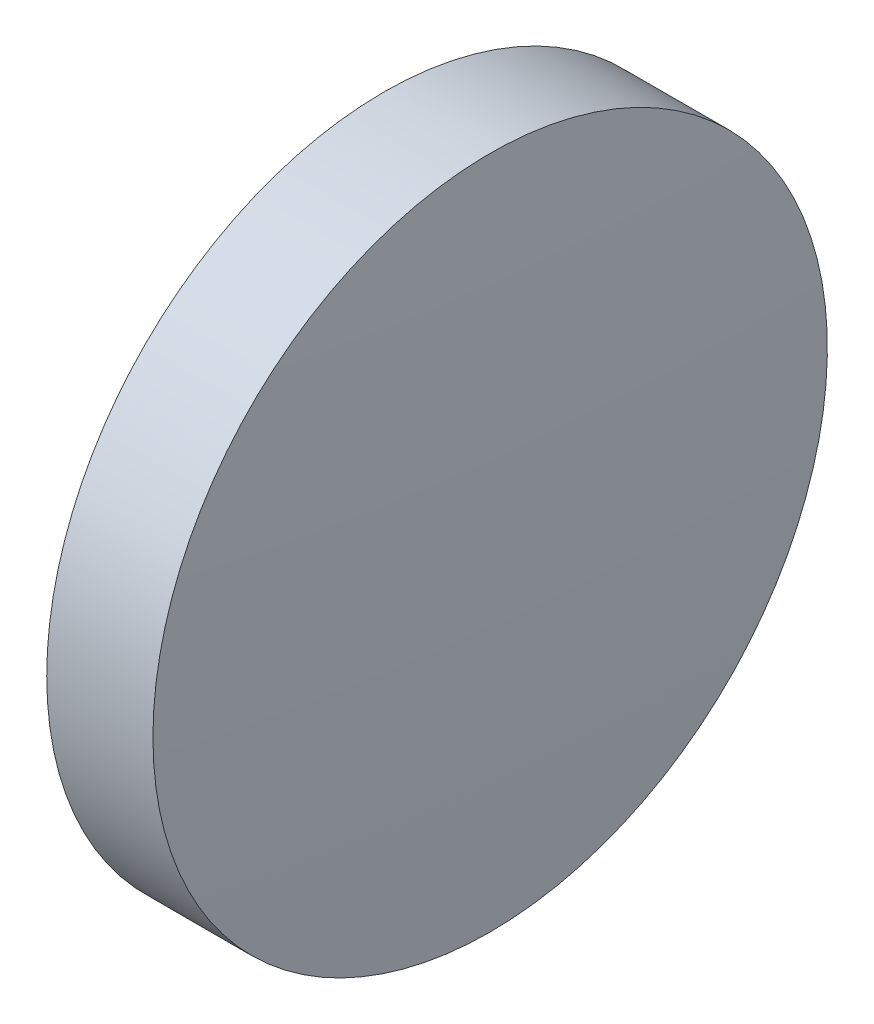
ISO-10303-21;
HEADER;
FILE_DESCRIPTION(('STEP AP214'),'2;1');
FILE_NAME('part.step','',(''),(''),'','','');
FILE_SCHEMA(('AUTOMOTIVE_DESIGN { 1 0 10303 214 1 1 1 1 }'));
ENDSEC;
DATA;
#1=APPLICATION_CONTEXT('core data for automotive mechanical design processes');
#2=APPLICATION_PROTOCOL_DEFINITION('international standard','automotive_design',2000,#1);
#3=PRODUCT_CONTEXT('',#1,'mechanical');
#4=PRODUCT('Part','Part','',(#3));
#5=PRODUCT_RELATED_PRODUCT_CATEGORY('part','',(#4));
#6=PRODUCT_DEFINITION_FORMATION('','',#4);
#7=PRODUCT_DEFINITION_CONTEXT('part definition',#1,'design');
#8=PRODUCT_DEFINITION('design','',#6,#7);
#9=PRODUCT_DEFINITION_SHAPE('','',#8);
#10=(LENGTH_UNIT() NAMED_UNIT(*) SI_UNIT(.MILLI.,.METRE.));
#11=(NAMED_UNIT(*) PLANE_ANGLE_UNIT() SI_UNIT($,.RADIAN.));
#12=(NAMED_UNIT(*) SI_UNIT($,.STERADIAN.) SOLID_ANGLE_UNIT());
#13=UNCERTAINTY_MEASURE_WITH_UNIT(LENGTH_MEASURE(1.E-05),#10,'distance_accuracy_value','');
#14=(GEOMETRIC_REPRESENTATION_CONTEXT(3) GLOBAL_UNCERTAINTY_ASSIGNED_CONTEXT((#13)) GLOBAL_UNIT_ASSIGNED_CONTEXT((#10,
#11,#12)) REPRESENTATION_CONTEXT('',''));
#15=CARTESIAN_POINT('',(0.,0.,0.));
#16=DIRECTION('',(0.,0.,1.));
#17=DIRECTION('',(1.,0.,0.));
#18=AXIS2_PLACEMENT_3D('',#15,#16,#17);
#19=CARTESIAN_POINT('',(142.959319578511,24.3080565115925,0.));
#20=DIRECTION('',(-1.,0.,0.));
#21=DIRECTION('',(0.,1.,0.));
#22=AXIS2_PLACEMENT_3D('',#19,#20,#21);
#23=SPHERICAL_SURFACE('',#22,100.930209405465);
#24=CARTESIAN_POINT('',(42.229062601617,24.3080565115924,0.));
#25=DIRECTION('',(-1.,0.,0.));
#26=DIRECTION('',(0.,0.,1.));
#27=AXIS2_PLACEMENT_3D('',#24,#25,#26);
#28=CIRCLE('',#27,6.35);
#29=CARTESIAN_POINT('',(42.229062601617,24.3080565115924,6.35));
#30=VERTEX_POINT('',#29);
#31=EDGE_CURVE('E46',#30,#30,#28,.T.);
#32=ORIENTED_EDGE('',*,*,#31,.T.);
#33=EDGE_LOOP('',(#32));
#34=FACE_BOUND('',#33,.T.);
#35=ADVANCED_FACE('F39',(#34),#23,.T.);
#36=CARTESIAN_POINT('',(-56.501125803844,24.3080565115925,0.));
#37=DIRECTION('',(-1.,0.,0.));
#38=DIRECTION('',(0.,-1.,0.));
#39=AXIS2_PLACEMENT_3D('',#36,#37,#38);
#40=SPHERICAL_SURFACE('',#39,100.930209405461);
#41=CARTESIAN_POINT('',(44.2291311730456,24.3080565115924,0.));
#42=DIRECTION('',(-1.,0.,0.));
#43=DIRECTION('',(0.,0.,1.));
#44=AXIS2_PLACEMENT_3D('',#41,#42,#43);
#45=CIRCLE('',#44,6.35);
#46=CARTESIAN_POINT('',(44.2291311730456,24.3080565115924,6.35));
#47=VERTEX_POINT('',#46);
#48=EDGE_CURVE('E10',#47,#47,#45,.T.);
#49=ORIENTED_EDGE('',*,*,#48,.F.);
#50=EDGE_LOOP('',(#49));
#51=FACE_BOUND('',#50,.T.);
#52=ADVANCED_FACE('F56',(#51),#40,.T.);
#53=CARTESIAN_POINT('',(39.6527006754186,24.3080565115924,0.));
#54=DIRECTION('',(-1.,0.,0.));
#55=DIRECTION('',(0.,0.,1.));
#56=AXIS2_PLACEMENT_3D('',#53,#54,#55);
#57=CYLINDRICAL_SURFACE('',#56,6.35);
#58=ORIENTED_EDGE('',*,*,#48,.T.);
#59=EDGE_LOOP('',(#58));
#60=FACE_BOUND('',#59,.T.);
#61=ORIENTED_EDGE('',*,*,#31,.F.);
#62=EDGE_LOOP('',(#61));
#63=FACE_BOUND('',#62,.T.);
#64=ADVANCED_FACE('F54',(#60,#63),#57,.T.);
#65=CLOSED_SHELL('',(#35,#52,#64));
#66=MANIFOLD_SOLID_BREP('B2',#65);
#67=ADVANCED_BREP_SHAPE_REPRESENTATION('',(#18,#66),#14);
#68=SHAPE_DEFINITION_REPRESENTATION(#9,#67);
ENDSEC;
END-ISO-10303-21;
